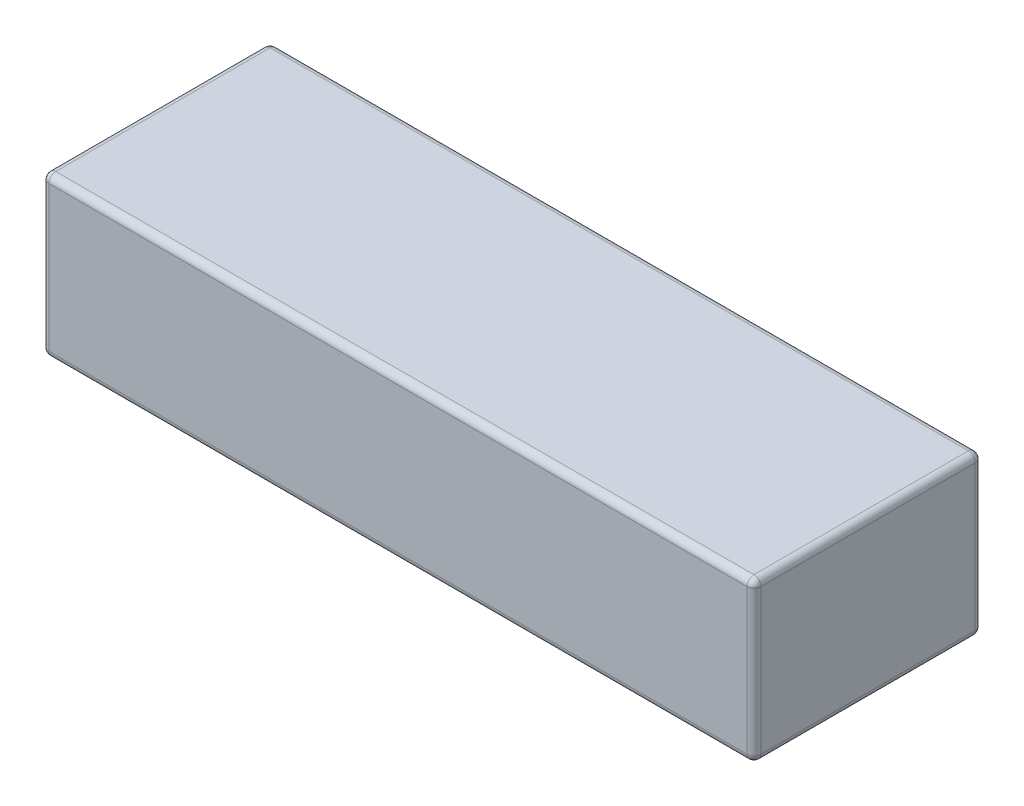
ISO-10303-21;
HEADER;
FILE_DESCRIPTION(('STEP AP214'),'2;1');
FILE_NAME('part.step','',(''),(''),'','','');
FILE_SCHEMA(('AUTOMOTIVE_DESIGN { 1 0 10303 214 1 1 1 1 }'));
ENDSEC;
DATA;
#1=APPLICATION_CONTEXT('core data for automotive mechanical design processes');
#2=APPLICATION_PROTOCOL_DEFINITION('international standard','automotive_design',2000,#1);
#3=PRODUCT_CONTEXT('',#1,'mechanical');
#4=PRODUCT('Part','Part','',(#3));
#5=PRODUCT_RELATED_PRODUCT_CATEGORY('part','',(#4));
#6=PRODUCT_DEFINITION_FORMATION('','',#4);
#7=PRODUCT_DEFINITION_CONTEXT('part definition',#1,'design');
#8=PRODUCT_DEFINITION('design','',#6,#7);
#9=PRODUCT_DEFINITION_SHAPE('','',#8);
#10=(LENGTH_UNIT() NAMED_UNIT(*) SI_UNIT(.MILLI.,.METRE.));
#11=(NAMED_UNIT(*) PLANE_ANGLE_UNIT() SI_UNIT($,.RADIAN.));
#12=(NAMED_UNIT(*) SI_UNIT($,.STERADIAN.) SOLID_ANGLE_UNIT());
#13=UNCERTAINTY_MEASURE_WITH_UNIT(LENGTH_MEASURE(1.E-05),#10,'distance_accuracy_value','');
#14=(GEOMETRIC_REPRESENTATION_CONTEXT(3) GLOBAL_UNCERTAINTY_ASSIGNED_CONTEXT((#13)) GLOBAL_UNIT_ASSIGNED_CONTEXT((#10,
#11,#12)) REPRESENTATION_CONTEXT('',''));
#15=CARTESIAN_POINT('',(0.,0.,0.));
#16=DIRECTION('',(0.,0.,1.));
#17=DIRECTION('',(1.,0.,0.));
#18=AXIS2_PLACEMENT_3D('',#15,#16,#17);
#19=CARTESIAN_POINT('',(103.,0.,0.));
#20=DIRECTION('',(0.,0.,-1.));
#21=DIRECTION('',(-1.,0.,0.));
#22=AXIS2_PLACEMENT_3D('',#19,#20,#21);
#23=PLANE('',#22);
#24=DIRECTION('',(0.,-1.,0.));
#25=VECTOR('',#24,1.);
#26=CARTESIAN_POINT('',(1.,0.,0.));
#27=LINE('',#26,#25);
#28=CARTESIAN_POINT('',(1.,22.,0.));
#29=VERTEX_POINT('',#28);
#30=CARTESIAN_POINT('',(1.,1.,0.));
#31=VERTEX_POINT('',#30);
#32=EDGE_CURVE('E180',#29,#31,#27,.T.);
#33=ORIENTED_EDGE('',*,*,#32,.T.);
#34=DIRECTION('',(-1.,0.,0.));
#35=VECTOR('',#34,1.);
#36=CARTESIAN_POINT('',(103.,1.,0.));
#37=LINE('',#36,#35);
#38=CARTESIAN_POINT('',(102.,1.,0.));
#39=VERTEX_POINT('',#38);
#40=EDGE_CURVE('E185',#31,#39,#37,.F.);
#41=ORIENTED_EDGE('',*,*,#40,.T.);
#42=DIRECTION('',(0.,-1.,0.));
#43=VECTOR('',#42,1.);
#44=CARTESIAN_POINT('',(102.,0.,0.));
#45=LINE('',#44,#43);
#46=CARTESIAN_POINT('',(102.,22.,0.));
#47=VERTEX_POINT('',#46);
#48=EDGE_CURVE('E182',#39,#47,#45,.F.);
#49=ORIENTED_EDGE('',*,*,#48,.T.);
#50=DIRECTION('',(-1.,0.,0.));
#51=VECTOR('',#50,1.);
#52=CARTESIAN_POINT('',(103.,22.,0.));
#53=LINE('',#52,#51);
#54=EDGE_CURVE('E178',#47,#29,#53,.T.);
#55=ORIENTED_EDGE('',*,*,#54,.T.);
#56=EDGE_LOOP('',(#33,#41,#49,#55));
#57=FACE_BOUND('',#56,.T.);
#58=ADVANCED_FACE('F34',(#57),#23,.F.);
#59=CARTESIAN_POINT('',(103.,0.,0.));
#60=DIRECTION('',(0.,1.,0.));
#61=DIRECTION('',(0.,0.,1.));
#62=AXIS2_PLACEMENT_3D('',#59,#60,#61);
#63=PLANE('',#62);
#64=DIRECTION('',(0.,0.,-1.));
#65=VECTOR('',#64,1.);
#66=CARTESIAN_POINT('',(102.,0.,0.));
#67=LINE('',#66,#65);
#68=CARTESIAN_POINT('',(102.,0.,-32.));
#69=VERTEX_POINT('',#68);
#70=CARTESIAN_POINT('',(102.,0.,-1.));
#71=VERTEX_POINT('',#70);
#72=EDGE_CURVE('E191',#69,#71,#67,.F.);
#73=ORIENTED_EDGE('',*,*,#72,.T.);
#74=DIRECTION('',(-1.,0.,0.));
#75=VECTOR('',#74,1.);
#76=CARTESIAN_POINT('',(103.,0.,-1.));
#77=LINE('',#76,#75);
#78=CARTESIAN_POINT('',(1.,0.,-1.));
#79=VERTEX_POINT('',#78);
#80=EDGE_CURVE('E193',#71,#79,#77,.T.);
#81=ORIENTED_EDGE('',*,*,#80,.T.);
#82=DIRECTION('',(0.,0.,-1.));
#83=VECTOR('',#82,1.);
#84=CARTESIAN_POINT('',(1.,0.,-33.));
#85=LINE('',#84,#83);
#86=CARTESIAN_POINT('',(1.,0.,-32.));
#87=VERTEX_POINT('',#86);
#88=EDGE_CURVE('E187',#79,#87,#85,.T.);
#89=ORIENTED_EDGE('',*,*,#88,.T.);
#90=DIRECTION('',(-1.,0.,0.));
#91=VECTOR('',#90,1.);
#92=CARTESIAN_POINT('',(103.,0.,-32.));
#93=LINE('',#92,#91);
#94=EDGE_CURVE('E189',#87,#69,#93,.F.);
#95=ORIENTED_EDGE('',*,*,#94,.T.);
#96=EDGE_LOOP('',(#73,#81,#89,#95));
#97=FACE_BOUND('',#96,.T.);
#98=ADVANCED_FACE('F273',(#97),#63,.F.);
#99=CARTESIAN_POINT('',(103.,0.,-33.));
#100=DIRECTION('',(0.,0.,1.));
#101=DIRECTION('',(1.,0.,0.));
#102=AXIS2_PLACEMENT_3D('',#99,#100,#101);
#103=PLANE('',#102);
#104=DIRECTION('',(0.,1.,0.));
#105=VECTOR('',#104,1.);
#106=CARTESIAN_POINT('',(102.,0.,-33.));
#107=LINE('',#106,#105);
#108=CARTESIAN_POINT('',(102.,22.,-33.));
#109=VERTEX_POINT('',#108);
#110=CARTESIAN_POINT('',(102.,1.,-33.));
#111=VERTEX_POINT('',#110);
#112=EDGE_CURVE('E152',#109,#111,#107,.F.);
#113=ORIENTED_EDGE('',*,*,#112,.T.);
#114=DIRECTION('',(-1.,0.,0.));
#115=VECTOR('',#114,1.);
#116=CARTESIAN_POINT('',(103.,1.,-33.));
#117=LINE('',#116,#115);
#118=CARTESIAN_POINT('',(1.,1.,-33.));
#119=VERTEX_POINT('',#118);
#120=EDGE_CURVE('E156',#111,#119,#117,.T.);
#121=ORIENTED_EDGE('',*,*,#120,.T.);
#122=DIRECTION('',(0.,1.,0.));
#123=VECTOR('',#122,1.);
#124=CARTESIAN_POINT('',(1.,23.,-33.));
#125=LINE('',#124,#123);
#126=CARTESIAN_POINT('',(1.,22.,-33.));
#127=VERTEX_POINT('',#126);
#128=EDGE_CURVE('E128',#119,#127,#125,.T.);
#129=ORIENTED_EDGE('',*,*,#128,.T.);
#130=DIRECTION('',(-1.,0.,0.));
#131=VECTOR('',#130,1.);
#132=CARTESIAN_POINT('',(103.,22.,-33.));
#133=LINE('',#132,#131);
#134=EDGE_CURVE('E146',#127,#109,#133,.F.);
#135=ORIENTED_EDGE('',*,*,#134,.T.);
#136=EDGE_LOOP('',(#113,#121,#129,#135));
#137=FACE_BOUND('',#136,.T.);
#138=ADVANCED_FACE('F154',(#137),#103,.F.);
#139=CARTESIAN_POINT('',(103.,23.,0.));
#140=DIRECTION('',(0.,-1.,0.));
#141=DIRECTION('',(0.,0.,-1.));
#142=AXIS2_PLACEMENT_3D('',#139,#140,#141);
#143=PLANE('',#142);
#144=DIRECTION('',(0.,0.,1.));
#145=VECTOR('',#144,1.);
#146=CARTESIAN_POINT('',(102.,23.,0.));
#147=LINE('',#146,#145);
#148=CARTESIAN_POINT('',(102.,23.,-1.));
#149=VERTEX_POINT('',#148);
#150=CARTESIAN_POINT('',(102.,23.,-32.));
#151=VERTEX_POINT('',#150);
#152=EDGE_CURVE('E43',#149,#151,#147,.F.);
#153=ORIENTED_EDGE('',*,*,#152,.T.);
#154=DIRECTION('',(-1.,0.,0.));
#155=VECTOR('',#154,1.);
#156=CARTESIAN_POINT('',(103.,23.,-32.));
#157=LINE('',#156,#155);
#158=CARTESIAN_POINT('',(1.,23.,-32.));
#159=VERTEX_POINT('',#158);
#160=EDGE_CURVE('E11',#151,#159,#157,.T.);
#161=ORIENTED_EDGE('',*,*,#160,.T.);
#162=DIRECTION('',(0.,0.,1.));
#163=VECTOR('',#162,1.);
#164=CARTESIAN_POINT('',(1.,23.,0.));
#165=LINE('',#164,#163);
#166=CARTESIAN_POINT('',(1.,23.,-1.));
#167=VERTEX_POINT('',#166);
#168=EDGE_CURVE('E196',#159,#167,#165,.T.);
#169=ORIENTED_EDGE('',*,*,#168,.T.);
#170=DIRECTION('',(-1.,0.,0.));
#171=VECTOR('',#170,1.);
#172=CARTESIAN_POINT('',(103.,23.,-1.));
#173=LINE('',#172,#171);
#174=EDGE_CURVE('E54',#167,#149,#173,.F.);
#175=ORIENTED_EDGE('',*,*,#174,.T.);
#176=EDGE_LOOP('',(#153,#161,#169,#175));
#177=FACE_BOUND('',#176,.T.);
#178=ADVANCED_FACE('F492',(#177),#143,.F.);
#179=CARTESIAN_POINT('',(103.,0.,0.));
#180=DIRECTION('',(-1.,0.,0.));
#181=DIRECTION('',(0.,0.,1.));
#182=AXIS2_PLACEMENT_3D('',#179,#180,#181);
#183=PLANE('',#182);
#184=DIRECTION('',(0.,-1.,0.));
#185=VECTOR('',#184,1.);
#186=CARTESIAN_POINT('',(103.,0.,-1.));
#187=LINE('',#186,#185);
#188=CARTESIAN_POINT('',(103.,22.,-1.));
#189=VERTEX_POINT('',#188);
#190=CARTESIAN_POINT('',(103.,1.,-1.));
#191=VERTEX_POINT('',#190);
#192=EDGE_CURVE('E171',#189,#191,#187,.T.);
#193=ORIENTED_EDGE('',*,*,#192,.T.);
#194=DIRECTION('',(0.,0.,-1.));
#195=VECTOR('',#194,1.);
#196=CARTESIAN_POINT('',(103.,1.,0.));
#197=LINE('',#196,#195);
#198=CARTESIAN_POINT('',(103.,1.,-32.));
#199=VERTEX_POINT('',#198);
#200=EDGE_CURVE('E176',#191,#199,#197,.T.);
#201=ORIENTED_EDGE('',*,*,#200,.T.);
#202=DIRECTION('',(0.,1.,0.));
#203=VECTOR('',#202,1.);
#204=CARTESIAN_POINT('',(103.,0.,-32.));
#205=LINE('',#204,#203);
#206=CARTESIAN_POINT('',(103.,22.,-32.));
#207=VERTEX_POINT('',#206);
#208=EDGE_CURVE('E173',#199,#207,#205,.T.);
#209=ORIENTED_EDGE('',*,*,#208,.T.);
#210=DIRECTION('',(0.,0.,1.));
#211=VECTOR('',#210,1.);
#212=CARTESIAN_POINT('',(103.,22.,0.));
#213=LINE('',#212,#211);
#214=EDGE_CURVE('E169',#207,#189,#213,.T.);
#215=ORIENTED_EDGE('',*,*,#214,.T.);
#216=EDGE_LOOP('',(#193,#201,#209,#215));
#217=FACE_BOUND('',#216,.T.);
#218=ADVANCED_FACE('F281',(#217),#183,.F.);
#219=CARTESIAN_POINT('',(0.,0.,0.));
#220=DIRECTION('',(-1.,0.,0.));
#221=DIRECTION('',(0.,0.,1.));
#222=AXIS2_PLACEMENT_3D('',#219,#220,#221);
#223=PLANE('',#222);
#224=DIRECTION('',(0.,1.,0.));
#225=VECTOR('',#224,1.);
#226=CARTESIAN_POINT('',(0.,0.,-32.));
#227=LINE('',#226,#225);
#228=CARTESIAN_POINT('',(0.,22.,-32.));
#229=VERTEX_POINT('',#228);
#230=CARTESIAN_POINT('',(0.,1.,-32.));
#231=VERTEX_POINT('',#230);
#232=EDGE_CURVE('E130',#229,#231,#227,.F.);
#233=ORIENTED_EDGE('',*,*,#232,.T.);
#234=DIRECTION('',(0.,0.,-1.));
#235=VECTOR('',#234,1.);
#236=CARTESIAN_POINT('',(0.,1.,0.));
#237=LINE('',#236,#235);
#238=CARTESIAN_POINT('',(0.,1.,-1.));
#239=VERTEX_POINT('',#238);
#240=EDGE_CURVE('E167',#231,#239,#237,.F.);
#241=ORIENTED_EDGE('',*,*,#240,.T.);
#242=DIRECTION('',(0.,-1.,0.));
#243=VECTOR('',#242,1.);
#244=CARTESIAN_POINT('',(0.,23.,-1.));
#245=LINE('',#244,#243);
#246=CARTESIAN_POINT('',(0.,22.,-1.));
#247=VERTEX_POINT('',#246);
#248=EDGE_CURVE('E164',#239,#247,#245,.F.);
#249=ORIENTED_EDGE('',*,*,#248,.T.);
#250=DIRECTION('',(0.,0.,1.));
#251=VECTOR('',#250,1.);
#252=CARTESIAN_POINT('',(0.,22.,-33.));
#253=LINE('',#252,#251);
#254=EDGE_CURVE('E159',#247,#229,#253,.F.);
#255=ORIENTED_EDGE('',*,*,#254,.T.);
#256=EDGE_LOOP('',(#233,#241,#249,#255));
#257=FACE_BOUND('',#256,.T.);
#258=ADVANCED_FACE('F307',(#257),#223,.T.);
#259=CARTESIAN_POINT('',(102.,0.,-1.));
#260=DIRECTION('',(0.,-1.,0.));
#261=DIRECTION('',(0.,0.,-1.));
#262=AXIS2_PLACEMENT_3D('',#259,#260,#261);
#263=CYLINDRICAL_SURFACE('',#262,1.);
#264=CARTESIAN_POINT('',(102.,1.,-1.));
#265=DIRECTION('',(0.,-1.,0.));
#266=DIRECTION('',(0.,0.,-1.));
#267=AXIS2_PLACEMENT_3D('',#264,#265,#266);
#268=CIRCLE('',#267,1.);
#269=EDGE_CURVE('E38',#191,#39,#268,.T.);
#270=ORIENTED_EDGE('',*,*,#269,.F.);
#271=ORIENTED_EDGE('',*,*,#192,.F.);
#272=CARTESIAN_POINT('',(102.,22.,-1.));
#273=DIRECTION('',(0.,1.,0.));
#274=DIRECTION('',(0.,0.,1.));
#275=AXIS2_PLACEMENT_3D('',#272,#273,#274);
#276=CIRCLE('',#275,1.);
#277=EDGE_CURVE('E250',#47,#189,#276,.T.);
#278=ORIENTED_EDGE('',*,*,#277,.F.);
#279=ORIENTED_EDGE('',*,*,#48,.F.);
#280=EDGE_LOOP('',(#270,#271,#278,#279));
#281=FACE_BOUND('',#280,.T.);
#282=ADVANCED_FACE('F36',(#281),#263,.T.);
#283=CARTESIAN_POINT('',(102.,1.,-1.));
#284=DIRECTION('',(0.,0.,1.));
#285=DIRECTION('',(1.,0.,0.));
#286=AXIS2_PLACEMENT_3D('',#283,#284,#285);
#287=SPHERICAL_SURFACE('',#286,1.);
#288=CARTESIAN_POINT('',(102.,1.,-1.));
#289=DIRECTION('',(0.,0.,1.));
#290=DIRECTION('',(1.,0.,0.));
#291=AXIS2_PLACEMENT_3D('',#288,#289,#290);
#292=CIRCLE('',#291,1.);
#293=EDGE_CURVE('E245',#191,#71,#292,.F.);
#294=ORIENTED_EDGE('',*,*,#293,.F.);
#295=ORIENTED_EDGE('',*,*,#269,.T.);
#296=CARTESIAN_POINT('',(102.,1.,-1.));
#297=DIRECTION('',(1.,0.,0.));
#298=DIRECTION('',(0.,0.,-1.));
#299=AXIS2_PLACEMENT_3D('',#296,#297,#298);
#300=CIRCLE('',#299,1.);
#301=EDGE_CURVE('E248',#71,#39,#300,.F.);
#302=ORIENTED_EDGE('',*,*,#301,.F.);
#303=EDGE_LOOP('',(#294,#295,#302));
#304=FACE_BOUND('',#303,.T.);
#305=ADVANCED_FACE('F261',(#304),#287,.T.);
#306=CARTESIAN_POINT('',(102.,22.,-1.));
#307=DIRECTION('',(0.,0.,1.));
#308=DIRECTION('',(1.,0.,0.));
#309=AXIS2_PLACEMENT_3D('',#306,#307,#308);
#310=SPHERICAL_SURFACE('',#309,1.);
#311=CARTESIAN_POINT('',(102.,22.,-1.));
#312=DIRECTION('',(1.,0.,0.));
#313=DIRECTION('',(0.,0.,-1.));
#314=AXIS2_PLACEMENT_3D('',#311,#312,#313);
#315=CIRCLE('',#314,1.);
#316=EDGE_CURVE('E240',#47,#149,#315,.F.);
#317=ORIENTED_EDGE('',*,*,#316,.F.);
#318=ORIENTED_EDGE('',*,*,#277,.T.);
#319=CARTESIAN_POINT('',(102.,22.,-1.));
#320=DIRECTION('',(0.,0.,1.));
#321=DIRECTION('',(1.,0.,0.));
#322=AXIS2_PLACEMENT_3D('',#319,#320,#321);
#323=CIRCLE('',#322,1.);
#324=EDGE_CURVE('E242',#149,#189,#323,.F.);
#325=ORIENTED_EDGE('',*,*,#324,.F.);
#326=EDGE_LOOP('',(#317,#318,#325));
#327=FACE_BOUND('',#326,.T.);
#328=ADVANCED_FACE('F458',(#327),#310,.T.);
#329=CARTESIAN_POINT('',(103.,1.,-1.));
#330=DIRECTION('',(-1.,0.,0.));
#331=DIRECTION('',(0.,0.,1.));
#332=AXIS2_PLACEMENT_3D('',#329,#330,#331);
#333=CYLINDRICAL_SURFACE('',#332,1.);
#334=ORIENTED_EDGE('',*,*,#301,.T.);
#335=ORIENTED_EDGE('',*,*,#40,.F.);
#336=CARTESIAN_POINT('',(1.,1.,-1.));
#337=DIRECTION('',(-1.,0.,0.));
#338=DIRECTION('',(0.,0.,1.));
#339=AXIS2_PLACEMENT_3D('',#336,#337,#338);
#340=CIRCLE('',#339,1.);
#341=EDGE_CURVE('E234',#79,#31,#340,.T.);
#342=ORIENTED_EDGE('',*,*,#341,.F.);
#343=ORIENTED_EDGE('',*,*,#80,.F.);
#344=EDGE_LOOP('',(#334,#335,#342,#343));
#345=FACE_BOUND('',#344,.T.);
#346=ADVANCED_FACE('F269',(#345),#333,.T.);
#347=CARTESIAN_POINT('',(102.,1.,0.));
#348=DIRECTION('',(0.,0.,-1.));
#349=DIRECTION('',(-1.,0.,0.));
#350=AXIS2_PLACEMENT_3D('',#347,#348,#349);
#351=CYLINDRICAL_SURFACE('',#350,1.);
#352=ORIENTED_EDGE('',*,*,#293,.T.);
#353=ORIENTED_EDGE('',*,*,#72,.F.);
#354=CARTESIAN_POINT('',(102.,1.,-32.));
#355=DIRECTION('',(0.,0.,-1.));
#356=DIRECTION('',(-1.,0.,0.));
#357=AXIS2_PLACEMENT_3D('',#354,#355,#356);
#358=CIRCLE('',#357,1.);
#359=EDGE_CURVE('E231',#199,#69,#358,.T.);
#360=ORIENTED_EDGE('',*,*,#359,.F.);
#361=ORIENTED_EDGE('',*,*,#200,.F.);
#362=EDGE_LOOP('',(#352,#353,#360,#361));
#363=FACE_BOUND('',#362,.T.);
#364=ADVANCED_FACE('F278',(#363),#351,.T.);
#365=CARTESIAN_POINT('',(102.,0.,-32.));
#366=DIRECTION('',(0.,1.,0.));
#367=DIRECTION('',(0.,0.,1.));
#368=AXIS2_PLACEMENT_3D('',#365,#366,#367);
#369=CYLINDRICAL_SURFACE('',#368,1.);
#370=CARTESIAN_POINT('',(102.,22.,-32.));
#371=DIRECTION('',(0.,1.,0.));
#372=DIRECTION('',(0.,0.,1.));
#373=AXIS2_PLACEMENT_3D('',#370,#371,#372);
#374=CIRCLE('',#373,1.);
#375=EDGE_CURVE('E225',#207,#109,#374,.T.);
#376=ORIENTED_EDGE('',*,*,#375,.F.);
#377=ORIENTED_EDGE('',*,*,#208,.F.);
#378=CARTESIAN_POINT('',(102.,1.,-32.));
#379=DIRECTION('',(0.,-1.,0.));
#380=DIRECTION('',(0.,0.,-1.));
#381=AXIS2_PLACEMENT_3D('',#378,#379,#380);
#382=CIRCLE('',#381,1.);
#383=EDGE_CURVE('E228',#111,#199,#382,.T.);
#384=ORIENTED_EDGE('',*,*,#383,.F.);
#385=ORIENTED_EDGE('',*,*,#112,.F.);
#386=EDGE_LOOP('',(#376,#377,#384,#385));
#387=FACE_BOUND('',#386,.T.);
#388=ADVANCED_FACE('F285',(#387),#369,.T.);
#389=CARTESIAN_POINT('',(102.,22.,0.));
#390=DIRECTION('',(0.,0.,1.));
#391=DIRECTION('',(1.,0.,0.));
#392=AXIS2_PLACEMENT_3D('',#389,#390,#391);
#393=CYLINDRICAL_SURFACE('',#392,1.);
#394=ORIENTED_EDGE('',*,*,#324,.T.);
#395=ORIENTED_EDGE('',*,*,#214,.F.);
#396=CARTESIAN_POINT('',(102.,22.,-32.));
#397=DIRECTION('',(0.,0.,-1.));
#398=DIRECTION('',(-1.,0.,0.));
#399=AXIS2_PLACEMENT_3D('',#396,#397,#398);
#400=CIRCLE('',#399,1.);
#401=EDGE_CURVE('E223',#151,#207,#400,.T.);
#402=ORIENTED_EDGE('',*,*,#401,.F.);
#403=ORIENTED_EDGE('',*,*,#152,.F.);
#404=EDGE_LOOP('',(#394,#395,#402,#403));
#405=FACE_BOUND('',#404,.T.);
#406=ADVANCED_FACE('F290',(#405),#393,.T.);
#407=CARTESIAN_POINT('',(103.,22.,-1.));
#408=DIRECTION('',(-1.,0.,0.));
#409=DIRECTION('',(0.,0.,1.));
#410=AXIS2_PLACEMENT_3D('',#407,#408,#409);
#411=CYLINDRICAL_SURFACE('',#410,1.);
#412=ORIENTED_EDGE('',*,*,#316,.T.);
#413=ORIENTED_EDGE('',*,*,#174,.F.);
#414=CARTESIAN_POINT('',(1.,22.,-1.));
#415=DIRECTION('',(-1.,0.,0.));
#416=DIRECTION('',(0.,0.,1.));
#417=AXIS2_PLACEMENT_3D('',#414,#415,#416);
#418=CIRCLE('',#417,1.);
#419=EDGE_CURVE('E220',#29,#167,#418,.T.);
#420=ORIENTED_EDGE('',*,*,#419,.F.);
#421=ORIENTED_EDGE('',*,*,#54,.F.);
#422=EDGE_LOOP('',(#412,#413,#420,#421));
#423=FACE_BOUND('',#422,.T.);
#424=ADVANCED_FACE('F300',(#423),#411,.T.);
#425=CARTESIAN_POINT('',(1.,0.,-1.));
#426=DIRECTION('',(0.,1.,0.));
#427=DIRECTION('',(0.,0.,1.));
#428=AXIS2_PLACEMENT_3D('',#425,#426,#427);
#429=CYLINDRICAL_SURFACE('',#428,1.);
#430=CARTESIAN_POINT('',(1.,1.,-1.));
#431=DIRECTION('',(0.,-1.,0.));
#432=DIRECTION('',(0.,0.,-1.));
#433=AXIS2_PLACEMENT_3D('',#430,#431,#432);
#434=CIRCLE('',#433,1.);
#435=EDGE_CURVE('E237',#31,#239,#434,.T.);
#436=ORIENTED_EDGE('',*,*,#435,.F.);
#437=ORIENTED_EDGE('',*,*,#32,.F.);
#438=CARTESIAN_POINT('',(1.,22.,-1.));
#439=DIRECTION('',(0.,1.,0.));
#440=DIRECTION('',(0.,0.,1.));
#441=AXIS2_PLACEMENT_3D('',#438,#439,#440);
#442=CIRCLE('',#441,1.);
#443=EDGE_CURVE('E217',#247,#29,#442,.T.);
#444=ORIENTED_EDGE('',*,*,#443,.F.);
#445=ORIENTED_EDGE('',*,*,#248,.F.);
#446=EDGE_LOOP('',(#436,#437,#444,#445));
#447=FACE_BOUND('',#446,.T.);
#448=ADVANCED_FACE('F296',(#447),#429,.T.);
#449=CARTESIAN_POINT('',(1.,1.,-1.));
#450=DIRECTION('',(0.,0.,1.));
#451=DIRECTION('',(1.,0.,0.));
#452=AXIS2_PLACEMENT_3D('',#449,#450,#451);
#453=SPHERICAL_SURFACE('',#452,1.);
#454=ORIENTED_EDGE('',*,*,#341,.T.);
#455=ORIENTED_EDGE('',*,*,#435,.T.);
#456=CARTESIAN_POINT('',(1.,1.,-1.));
#457=DIRECTION('',(0.,0.,1.));
#458=DIRECTION('',(1.,0.,0.));
#459=AXIS2_PLACEMENT_3D('',#456,#457,#458);
#460=CIRCLE('',#459,1.);
#461=EDGE_CURVE('E214',#79,#239,#460,.F.);
#462=ORIENTED_EDGE('',*,*,#461,.F.);
#463=EDGE_LOOP('',(#454,#455,#462));
#464=FACE_BOUND('',#463,.T.);
#465=ADVANCED_FACE('F311',(#464),#453,.T.);
#466=CARTESIAN_POINT('',(102.,1.,-32.));
#467=DIRECTION('',(0.,0.,1.));
#468=DIRECTION('',(1.,0.,0.));
#469=AXIS2_PLACEMENT_3D('',#466,#467,#468);
#470=SPHERICAL_SURFACE('',#469,1.);
#471=ORIENTED_EDGE('',*,*,#383,.T.);
#472=ORIENTED_EDGE('',*,*,#359,.T.);
#473=CARTESIAN_POINT('',(102.,1.,-32.));
#474=DIRECTION('',(1.,0.,0.));
#475=DIRECTION('',(0.,0.,-1.));
#476=AXIS2_PLACEMENT_3D('',#473,#474,#475);
#477=CIRCLE('',#476,1.);
#478=EDGE_CURVE('E211',#111,#69,#477,.F.);
#479=ORIENTED_EDGE('',*,*,#478,.F.);
#480=EDGE_LOOP('',(#471,#472,#479));
#481=FACE_BOUND('',#480,.T.);
#482=ADVANCED_FACE('F321',(#481),#470,.T.);
#483=CARTESIAN_POINT('',(102.,22.,-32.));
#484=DIRECTION('',(0.,0.,1.));
#485=DIRECTION('',(1.,0.,0.));
#486=AXIS2_PLACEMENT_3D('',#483,#484,#485);
#487=SPHERICAL_SURFACE('',#486,1.);
#488=ORIENTED_EDGE('',*,*,#401,.T.);
#489=ORIENTED_EDGE('',*,*,#375,.T.);
#490=CARTESIAN_POINT('',(102.,22.,-32.));
#491=DIRECTION('',(1.,0.,0.));
#492=DIRECTION('',(0.,0.,-1.));
#493=AXIS2_PLACEMENT_3D('',#490,#491,#492);
#494=CIRCLE('',#493,1.);
#495=EDGE_CURVE('E149',#151,#109,#494,.F.);
#496=ORIENTED_EDGE('',*,*,#495,.F.);
#497=EDGE_LOOP('',(#488,#489,#496));
#498=FACE_BOUND('',#497,.T.);
#499=ADVANCED_FACE('F323',(#498),#487,.T.);
#500=CARTESIAN_POINT('',(1.,22.,-1.));
#501=DIRECTION('',(0.,0.,1.));
#502=DIRECTION('',(1.,0.,0.));
#503=AXIS2_PLACEMENT_3D('',#500,#501,#502);
#504=SPHERICAL_SURFACE('',#503,1.);
#505=ORIENTED_EDGE('',*,*,#443,.T.);
#506=ORIENTED_EDGE('',*,*,#419,.T.);
#507=CARTESIAN_POINT('',(1.,22.,-1.));
#508=DIRECTION('',(0.,0.,1.));
#509=DIRECTION('',(1.,0.,0.));
#510=AXIS2_PLACEMENT_3D('',#507,#508,#509);
#511=CIRCLE('',#510,1.);
#512=EDGE_CURVE('E207',#247,#167,#511,.F.);
#513=ORIENTED_EDGE('',*,*,#512,.F.);
#514=EDGE_LOOP('',(#505,#506,#513));
#515=FACE_BOUND('',#514,.T.);
#516=ADVANCED_FACE('F302',(#515),#504,.T.);
#517=CARTESIAN_POINT('',(1.,1.,0.));
#518=DIRECTION('',(0.,0.,1.));
#519=DIRECTION('',(1.,0.,0.));
#520=AXIS2_PLACEMENT_3D('',#517,#518,#519);
#521=CYLINDRICAL_SURFACE('',#520,1.);
#522=ORIENTED_EDGE('',*,*,#461,.T.);
#523=ORIENTED_EDGE('',*,*,#240,.F.);
#524=CARTESIAN_POINT('',(1.,1.,-32.));
#525=DIRECTION('',(0.,0.,-1.));
#526=DIRECTION('',(-1.,0.,0.));
#527=AXIS2_PLACEMENT_3D('',#524,#525,#526);
#528=CIRCLE('',#527,1.);
#529=EDGE_CURVE('E204',#87,#231,#528,.T.);
#530=ORIENTED_EDGE('',*,*,#529,.F.);
#531=ORIENTED_EDGE('',*,*,#88,.F.);
#532=EDGE_LOOP('',(#522,#523,#530,#531));
#533=FACE_BOUND('',#532,.T.);
#534=ADVANCED_FACE('F313',(#533),#521,.T.);
#535=CARTESIAN_POINT('',(103.,1.,-32.));
#536=DIRECTION('',(-1.,0.,0.));
#537=DIRECTION('',(0.,0.,1.));
#538=AXIS2_PLACEMENT_3D('',#535,#536,#537);
#539=CYLINDRICAL_SURFACE('',#538,1.);
#540=ORIENTED_EDGE('',*,*,#478,.T.);
#541=ORIENTED_EDGE('',*,*,#94,.F.);
#542=CARTESIAN_POINT('',(1.,1.,-32.));
#543=DIRECTION('',(-1.,0.,0.));
#544=DIRECTION('',(0.,0.,1.));
#545=AXIS2_PLACEMENT_3D('',#542,#543,#544);
#546=CIRCLE('',#545,1.);
#547=EDGE_CURVE('E143',#119,#87,#546,.T.);
#548=ORIENTED_EDGE('',*,*,#547,.F.);
#549=ORIENTED_EDGE('',*,*,#120,.F.);
#550=EDGE_LOOP('',(#540,#541,#548,#549));
#551=FACE_BOUND('',#550,.T.);
#552=ADVANCED_FACE('F319',(#551),#539,.T.);
#553=CARTESIAN_POINT('',(103.,22.,-32.));
#554=DIRECTION('',(-1.,0.,0.));
#555=DIRECTION('',(0.,0.,1.));
#556=AXIS2_PLACEMENT_3D('',#553,#554,#555);
#557=CYLINDRICAL_SURFACE('',#556,1.);
#558=ORIENTED_EDGE('',*,*,#495,.T.);
#559=ORIENTED_EDGE('',*,*,#134,.F.);
#560=CARTESIAN_POINT('',(1.,22.,-32.));
#561=DIRECTION('',(-1.,0.,0.));
#562=DIRECTION('',(0.,0.,1.));
#563=AXIS2_PLACEMENT_3D('',#560,#561,#562);
#564=CIRCLE('',#563,1.);
#565=EDGE_CURVE('E135',#159,#127,#564,.T.);
#566=ORIENTED_EDGE('',*,*,#565,.F.);
#567=ORIENTED_EDGE('',*,*,#160,.F.);
#568=EDGE_LOOP('',(#558,#559,#566,#567));
#569=FACE_BOUND('',#568,.T.);
#570=ADVANCED_FACE('F147',(#569),#557,.T.);
#571=CARTESIAN_POINT('',(1.,22.,0.));
#572=DIRECTION('',(0.,0.,-1.));
#573=DIRECTION('',(-1.,0.,0.));
#574=AXIS2_PLACEMENT_3D('',#571,#572,#573);
#575=CYLINDRICAL_SURFACE('',#574,1.);
#576=ORIENTED_EDGE('',*,*,#512,.T.);
#577=ORIENTED_EDGE('',*,*,#168,.F.);
#578=CARTESIAN_POINT('',(1.,22.,-32.));
#579=DIRECTION('',(0.,0.,-1.));
#580=DIRECTION('',(-1.,0.,0.));
#581=AXIS2_PLACEMENT_3D('',#578,#579,#580);
#582=CIRCLE('',#581,1.);
#583=EDGE_CURVE('E139',#229,#159,#582,.T.);
#584=ORIENTED_EDGE('',*,*,#583,.F.);
#585=ORIENTED_EDGE('',*,*,#254,.F.);
#586=EDGE_LOOP('',(#576,#577,#584,#585));
#587=FACE_BOUND('',#586,.T.);
#588=ADVANCED_FACE('F305',(#587),#575,.T.);
#589=CARTESIAN_POINT('',(1.,1.,-32.));
#590=DIRECTION('',(0.,0.,1.));
#591=DIRECTION('',(1.,0.,0.));
#592=AXIS2_PLACEMENT_3D('',#589,#590,#591);
#593=SPHERICAL_SURFACE('',#592,1.);
#594=ORIENTED_EDGE('',*,*,#547,.T.);
#595=ORIENTED_EDGE('',*,*,#529,.T.);
#596=CARTESIAN_POINT('',(1.,1.,-32.));
#597=DIRECTION('',(0.,-1.,0.));
#598=DIRECTION('',(0.,0.,-1.));
#599=AXIS2_PLACEMENT_3D('',#596,#597,#598);
#600=CIRCLE('',#599,1.);
#601=EDGE_CURVE('E132',#119,#231,#600,.F.);
#602=ORIENTED_EDGE('',*,*,#601,.F.);
#603=EDGE_LOOP('',(#594,#595,#602));
#604=FACE_BOUND('',#603,.T.);
#605=ADVANCED_FACE('F317',(#604),#593,.T.);
#606=CARTESIAN_POINT('',(1.,22.,-32.));
#607=DIRECTION('',(0.,0.,1.));
#608=DIRECTION('',(1.,0.,0.));
#609=AXIS2_PLACEMENT_3D('',#606,#607,#608);
#610=SPHERICAL_SURFACE('',#609,1.);
#611=ORIENTED_EDGE('',*,*,#583,.T.);
#612=ORIENTED_EDGE('',*,*,#565,.T.);
#613=CARTESIAN_POINT('',(1.,22.,-32.));
#614=DIRECTION('',(0.,1.,0.));
#615=DIRECTION('',(0.,0.,1.));
#616=AXIS2_PLACEMENT_3D('',#613,#614,#615);
#617=CIRCLE('',#616,1.);
#618=EDGE_CURVE('E124',#229,#127,#617,.F.);
#619=ORIENTED_EDGE('',*,*,#618,.F.);
#620=EDGE_LOOP('',(#611,#612,#619));
#621=FACE_BOUND('',#620,.T.);
#622=ADVANCED_FACE('F137',(#621),#610,.T.);
#623=CARTESIAN_POINT('',(1.,0.,-32.));
#624=DIRECTION('',(0.,-1.,0.));
#625=DIRECTION('',(0.,0.,-1.));
#626=AXIS2_PLACEMENT_3D('',#623,#624,#625);
#627=CYLINDRICAL_SURFACE('',#626,1.);
#628=ORIENTED_EDGE('',*,*,#601,.T.);
#629=ORIENTED_EDGE('',*,*,#232,.F.);
#630=ORIENTED_EDGE('',*,*,#618,.T.);
#631=ORIENTED_EDGE('',*,*,#128,.F.);
#632=EDGE_LOOP('',(#628,#629,#630,#631));
#633=FACE_BOUND('',#632,.T.);
#634=ADVANCED_FACE('F126',(#633),#627,.T.);
#635=CLOSED_SHELL('',(#58,#98,#138,#178,#218,#258,#282,#305,#328,#346,#364,#388,#406,#424,#448,
#465,#482,#499,#516,#534,#552,#570,#588,#605,#622,#634));
#636=MANIFOLD_SOLID_BREP('B2',#635);
#637=ADVANCED_BREP_SHAPE_REPRESENTATION('',(#18,#636),#14);
#638=SHAPE_DEFINITION_REPRESENTATION(#9,#637);
ENDSEC;
END-ISO-10303-21;
